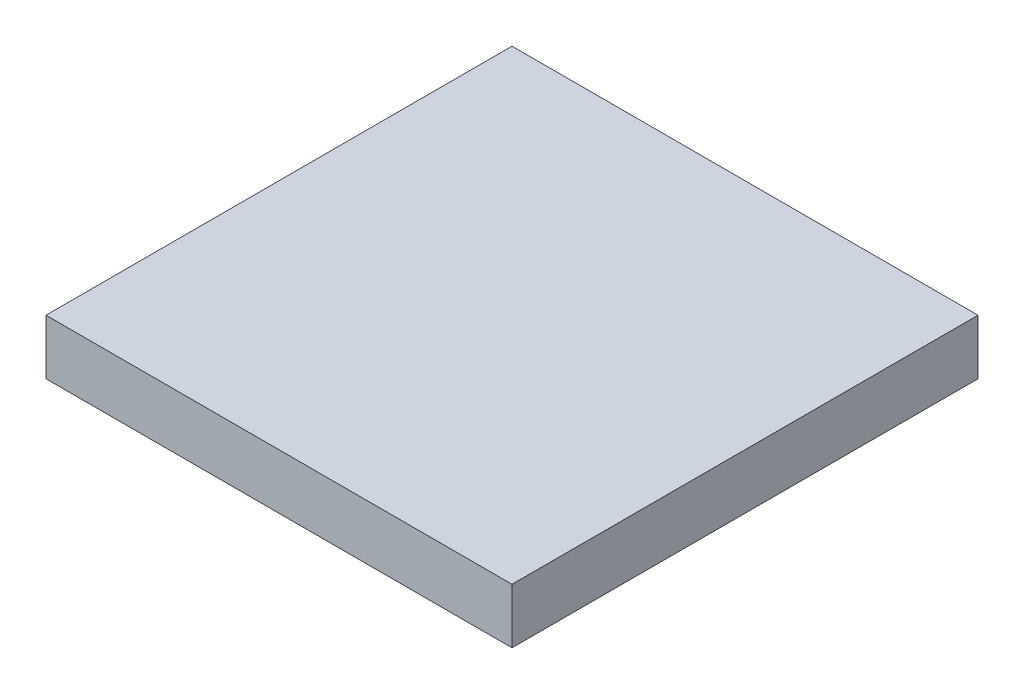
ISO-10303-21;
HEADER;
FILE_DESCRIPTION(('STEP AP214'),'2;1');
FILE_NAME('part.step','',(''),(''),'','','');
FILE_SCHEMA(('AUTOMOTIVE_DESIGN { 1 0 10303 214 1 1 1 1 }'));
ENDSEC;
DATA;
#1=APPLICATION_CONTEXT('core data for automotive mechanical design processes');
#2=APPLICATION_PROTOCOL_DEFINITION('international standard','automotive_design',2000,#1);
#3=PRODUCT_CONTEXT('',#1,'mechanical');
#4=PRODUCT('Part','Part','',(#3));
#5=PRODUCT_RELATED_PRODUCT_CATEGORY('part','',(#4));
#6=PRODUCT_DEFINITION_FORMATION('','',#4);
#7=PRODUCT_DEFINITION_CONTEXT('part definition',#1,'design');
#8=PRODUCT_DEFINITION('design','',#6,#7);
#9=PRODUCT_DEFINITION_SHAPE('','',#8);
#10=(LENGTH_UNIT() NAMED_UNIT(*) SI_UNIT(.MILLI.,.METRE.));
#11=(NAMED_UNIT(*) PLANE_ANGLE_UNIT() SI_UNIT($,.RADIAN.));
#12=(NAMED_UNIT(*) SI_UNIT($,.STERADIAN.) SOLID_ANGLE_UNIT());
#13=UNCERTAINTY_MEASURE_WITH_UNIT(LENGTH_MEASURE(1.E-05),#10,'distance_accuracy_value','');
#14=(GEOMETRIC_REPRESENTATION_CONTEXT(3) GLOBAL_UNCERTAINTY_ASSIGNED_CONTEXT((#13)) GLOBAL_UNIT_ASSIGNED_CONTEXT((#10,
#11,#12)) REPRESENTATION_CONTEXT('',''));
#15=CARTESIAN_POINT('',(0.,0.,0.));
#16=DIRECTION('',(0.,0.,1.));
#17=DIRECTION('',(1.,0.,0.));
#18=AXIS2_PLACEMENT_3D('',#15,#16,#17);
#19=CARTESIAN_POINT('',(6.35,1.5,6.35));
#20=DIRECTION('',(-1.,0.,0.));
#21=DIRECTION('',(0.,0.,1.));
#22=AXIS2_PLACEMENT_3D('',#19,#20,#21);
#23=PLANE('',#22);
#24=DIRECTION('',(0.,0.,-1.));
#25=VECTOR('',#24,1.);
#26=CARTESIAN_POINT('',(6.35,0.,6.35));
#27=LINE('',#26,#25);
#28=CARTESIAN_POINT('',(6.35,0.,6.35));
#29=VERTEX_POINT('',#28);
#30=CARTESIAN_POINT('',(6.35,0.,-6.35));
#31=VERTEX_POINT('',#30);
#32=EDGE_CURVE('E98',#29,#31,#27,.T.);
#33=ORIENTED_EDGE('',*,*,#32,.T.);
#34=DIRECTION('',(0.,-1.,0.));
#35=VECTOR('',#34,1.);
#36=CARTESIAN_POINT('',(6.35,1.5,-6.35));
#37=LINE('',#36,#35);
#38=CARTESIAN_POINT('',(6.35,1.5,-6.35));
#39=VERTEX_POINT('',#38);
#40=EDGE_CURVE('E11',#39,#31,#37,.T.);
#41=ORIENTED_EDGE('',*,*,#40,.F.);
#42=DIRECTION('',(0.,0.,-1.));
#43=VECTOR('',#42,1.);
#44=CARTESIAN_POINT('',(6.35,1.5,6.35));
#45=LINE('',#44,#43);
#46=CARTESIAN_POINT('',(6.35,1.5,6.35));
#47=VERTEX_POINT('',#46);
#48=EDGE_CURVE('E86',#47,#39,#45,.T.);
#49=ORIENTED_EDGE('',*,*,#48,.F.);
#50=DIRECTION('',(0.,-1.,0.));
#51=VECTOR('',#50,1.);
#52=CARTESIAN_POINT('',(6.35,1.5,6.35));
#53=LINE('',#52,#51);
#54=EDGE_CURVE('E94',#47,#29,#53,.T.);
#55=ORIENTED_EDGE('',*,*,#54,.T.);
#56=EDGE_LOOP('',(#33,#41,#49,#55));
#57=FACE_BOUND('',#56,.T.);
#58=ADVANCED_FACE('F35',(#57),#23,.F.);
#59=CARTESIAN_POINT('',(-6.35,1.5,-6.35));
#60=DIRECTION('',(0.,0.,1.));
#61=DIRECTION('',(1.,0.,0.));
#62=AXIS2_PLACEMENT_3D('',#59,#60,#61);
#63=PLANE('',#62);
#64=DIRECTION('',(-1.,0.,0.));
#65=VECTOR('',#64,1.);
#66=CARTESIAN_POINT('',(-6.35,0.,-6.35));
#67=LINE('',#66,#65);
#68=CARTESIAN_POINT('',(-6.35,0.,-6.35));
#69=VERTEX_POINT('',#68);
#70=EDGE_CURVE('E90',#31,#69,#67,.T.);
#71=ORIENTED_EDGE('',*,*,#70,.T.);
#72=DIRECTION('',(0.,-1.,0.));
#73=VECTOR('',#72,1.);
#74=CARTESIAN_POINT('',(-6.35,1.5,-6.35));
#75=LINE('',#74,#73);
#76=CARTESIAN_POINT('',(-6.35,1.5,-6.35));
#77=VERTEX_POINT('',#76);
#78=EDGE_CURVE('E43',#77,#69,#75,.T.);
#79=ORIENTED_EDGE('',*,*,#78,.F.);
#80=DIRECTION('',(-1.,0.,0.));
#81=VECTOR('',#80,1.);
#82=CARTESIAN_POINT('',(-6.35,1.5,-6.35));
#83=LINE('',#82,#81);
#84=EDGE_CURVE('E81',#39,#77,#83,.T.);
#85=ORIENTED_EDGE('',*,*,#84,.F.);
#86=ORIENTED_EDGE('',*,*,#40,.T.);
#87=EDGE_LOOP('',(#71,#79,#85,#86));
#88=FACE_BOUND('',#87,.T.);
#89=ADVANCED_FACE('F89',(#88),#63,.F.);
#90=CARTESIAN_POINT('',(-6.35,1.5,6.35));
#91=DIRECTION('',(1.,0.,0.));
#92=DIRECTION('',(0.,0.,-1.));
#93=AXIS2_PLACEMENT_3D('',#90,#91,#92);
#94=PLANE('',#93);
#95=DIRECTION('',(0.,0.,1.));
#96=VECTOR('',#95,1.);
#97=CARTESIAN_POINT('',(-6.35,0.,6.35));
#98=LINE('',#97,#96);
#99=CARTESIAN_POINT('',(-6.35,0.,6.35));
#100=VERTEX_POINT('',#99);
#101=EDGE_CURVE('E68',#69,#100,#98,.T.);
#102=ORIENTED_EDGE('',*,*,#101,.T.);
#103=DIRECTION('',(0.,-1.,0.));
#104=VECTOR('',#103,1.);
#105=CARTESIAN_POINT('',(-6.35,1.5,6.35));
#106=LINE('',#105,#104);
#107=CARTESIAN_POINT('',(-6.35,1.5,6.35));
#108=VERTEX_POINT('',#107);
#109=EDGE_CURVE('E91',#108,#100,#106,.T.);
#110=ORIENTED_EDGE('',*,*,#109,.F.);
#111=DIRECTION('',(0.,0.,1.));
#112=VECTOR('',#111,1.);
#113=CARTESIAN_POINT('',(-6.35,1.5,6.35));
#114=LINE('',#113,#112);
#115=EDGE_CURVE('E84',#77,#108,#114,.T.);
#116=ORIENTED_EDGE('',*,*,#115,.F.);
#117=ORIENTED_EDGE('',*,*,#78,.T.);
#118=EDGE_LOOP('',(#102,#110,#116,#117));
#119=FACE_BOUND('',#118,.T.);
#120=ADVANCED_FACE('F92',(#119),#94,.F.);
#121=CARTESIAN_POINT('',(-6.35,1.5,6.35));
#122=DIRECTION('',(0.,0.,-1.));
#123=DIRECTION('',(-1.,0.,0.));
#124=AXIS2_PLACEMENT_3D('',#121,#122,#123);
#125=PLANE('',#124);
#126=DIRECTION('',(1.,0.,0.));
#127=VECTOR('',#126,1.);
#128=CARTESIAN_POINT('',(-6.35,0.,6.35));
#129=LINE('',#128,#127);
#130=EDGE_CURVE('E74',#100,#29,#129,.T.);
#131=ORIENTED_EDGE('',*,*,#130,.T.);
#132=ORIENTED_EDGE('',*,*,#54,.F.);
#133=DIRECTION('',(1.,0.,0.));
#134=VECTOR('',#133,1.);
#135=CARTESIAN_POINT('',(-6.35,1.5,6.35));
#136=LINE('',#135,#134);
#137=EDGE_CURVE('E51',#108,#47,#136,.T.);
#138=ORIENTED_EDGE('',*,*,#137,.F.);
#139=ORIENTED_EDGE('',*,*,#109,.T.);
#140=EDGE_LOOP('',(#131,#132,#138,#139));
#141=FACE_BOUND('',#140,.T.);
#142=ADVANCED_FACE('F105',(#141),#125,.F.);
#143=CARTESIAN_POINT('',(0.,1.5,0.));
#144=DIRECTION('',(0.,-1.,0.));
#145=DIRECTION('',(0.,0.,-1.));
#146=AXIS2_PLACEMENT_3D('',#143,#144,#145);
#147=PLANE('',#146);
#148=ORIENTED_EDGE('',*,*,#48,.T.);
#149=ORIENTED_EDGE('',*,*,#84,.T.);
#150=ORIENTED_EDGE('',*,*,#115,.T.);
#151=ORIENTED_EDGE('',*,*,#137,.T.);
#152=EDGE_LOOP('',(#148,#149,#150,#151));
#153=FACE_BOUND('',#152,.T.);
#154=ADVANCED_FACE('F82',(#153),#147,.F.);
#155=CARTESIAN_POINT('',(0.,0.,0.));
#156=DIRECTION('',(0.,-1.,0.));
#157=DIRECTION('',(0.,0.,-1.));
#158=AXIS2_PLACEMENT_3D('',#155,#156,#157);
#159=PLANE('',#158);
#160=ORIENTED_EDGE('',*,*,#32,.F.);
#161=ORIENTED_EDGE('',*,*,#130,.F.);
#162=ORIENTED_EDGE('',*,*,#101,.F.);
#163=ORIENTED_EDGE('',*,*,#70,.F.);
#164=EDGE_LOOP('',(#160,#161,#162,#163));
#165=FACE_BOUND('',#164,.T.);
#166=ADVANCED_FACE('F108',(#165),#159,.T.);
#167=CLOSED_SHELL('',(#58,#89,#120,#142,#154,#166));
#168=MANIFOLD_SOLID_BREP('B2',#167);
#169=ADVANCED_BREP_SHAPE_REPRESENTATION('',(#18,#168),#14);
#170=SHAPE_DEFINITION_REPRESENTATION(#9,#169);
ENDSEC;
END-ISO-10303-21;
